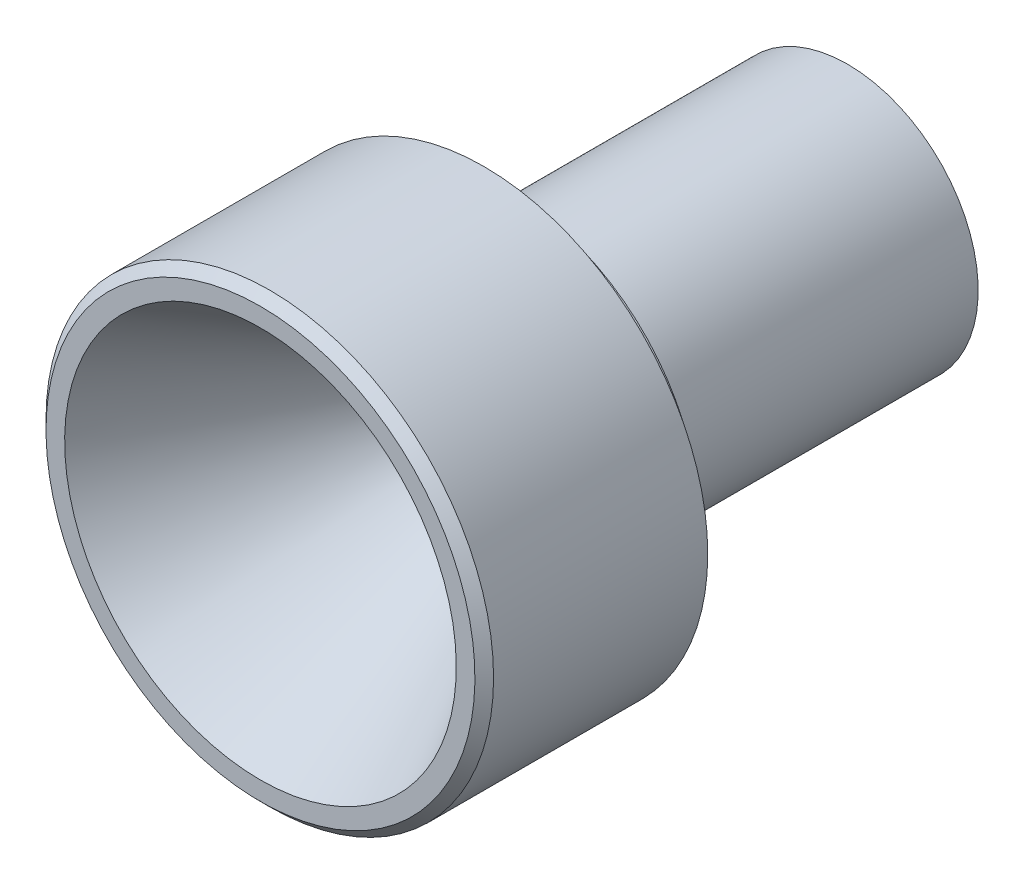
ISO-10303-21;
HEADER;
FILE_DESCRIPTION(('STEP AP214'),'2;1');
FILE_NAME('part.step','',(''),(''),'','','');
FILE_SCHEMA(('AUTOMOTIVE_DESIGN { 1 0 10303 214 1 1 1 1 }'));
ENDSEC;
DATA;
#1=APPLICATION_CONTEXT('core data for automotive mechanical design processes');
#2=APPLICATION_PROTOCOL_DEFINITION('international standard','automotive_design',2000,#1);
#3=PRODUCT_CONTEXT('',#1,'mechanical');
#4=PRODUCT('Part','Part','',(#3));
#5=PRODUCT_RELATED_PRODUCT_CATEGORY('part','',(#4));
#6=PRODUCT_DEFINITION_FORMATION('','',#4);
#7=PRODUCT_DEFINITION_CONTEXT('part definition',#1,'design');
#8=PRODUCT_DEFINITION('design','',#6,#7);
#9=PRODUCT_DEFINITION_SHAPE('','',#8);
#10=(LENGTH_UNIT() NAMED_UNIT(*) SI_UNIT(.MILLI.,.METRE.));
#11=(NAMED_UNIT(*) PLANE_ANGLE_UNIT() SI_UNIT($,.RADIAN.));
#12=(NAMED_UNIT(*) SI_UNIT($,.STERADIAN.) SOLID_ANGLE_UNIT());
#13=UNCERTAINTY_MEASURE_WITH_UNIT(LENGTH_MEASURE(1.E-05),#10,'distance_accuracy_value','');
#14=(GEOMETRIC_REPRESENTATION_CONTEXT(3) GLOBAL_UNCERTAINTY_ASSIGNED_CONTEXT((#13)) GLOBAL_UNIT_ASSIGNED_CONTEXT((#10,
#11,#12)) REPRESENTATION_CONTEXT('',''));
#15=CARTESIAN_POINT('',(0.,0.,0.));
#16=DIRECTION('',(0.,0.,1.));
#17=DIRECTION('',(1.,0.,0.));
#18=AXIS2_PLACEMENT_3D('',#15,#16,#17);
#19=CARTESIAN_POINT('',(0.,0.,15.742003569016));
#20=DIRECTION('',(0.,0.,1.));
#21=DIRECTION('',(0.,-1.,0.));
#22=AXIS2_PLACEMENT_3D('',#19,#20,#21);
#23=CYLINDRICAL_SURFACE('',#22,12.);
#24=CARTESIAN_POINT('',(0.,0.,15.242003569016));
#25=DIRECTION('',(0.,0.,-1.));
#26=DIRECTION('',(0.,1.,0.));
#27=AXIS2_PLACEMENT_3D('',#24,#25,#26);
#28=CIRCLE('',#27,12.);
#29=CARTESIAN_POINT('',(0.,12.,15.242003569016));
#30=VERTEX_POINT('',#29);
#31=EDGE_CURVE('E10',#30,#30,#28,.T.);
#32=ORIENTED_EDGE('',*,*,#31,.T.);
#33=EDGE_LOOP('',(#32));
#34=FACE_BOUND('',#33,.T.);
#35=CARTESIAN_POINT('',(0.,0.,3.75799643098404));
#36=DIRECTION('',(0.,0.,1.));
#37=DIRECTION('',(0.,-1.,0.));
#38=AXIS2_PLACEMENT_3D('',#35,#36,#37);
#39=CIRCLE('',#38,12.);
#40=CARTESIAN_POINT('',(0.,-12.,3.75799643098404));
#41=VERTEX_POINT('',#40);
#42=EDGE_CURVE('E42',#41,#41,#39,.T.);
#43=ORIENTED_EDGE('',*,*,#42,.T.);
#44=EDGE_LOOP('',(#43));
#45=FACE_BOUND('',#44,.T.);
#46=ADVANCED_FACE('F31',(#34,#45),#23,.T.);
#47=CARTESIAN_POINT('',(0.,12.,3.75799643098404));
#48=DIRECTION('',(0.,0.,1.));
#49=DIRECTION('',(0.,-1.,0.));
#50=AXIS2_PLACEMENT_3D('',#47,#48,#49);
#51=PLANE('',#50);
#52=ORIENTED_EDGE('',*,*,#42,.F.);
#53=EDGE_LOOP('',(#52));
#54=FACE_BOUND('',#53,.T.);
#55=CARTESIAN_POINT('',(0.,0.,3.75799643098404));
#56=DIRECTION('',(0.,0.,1.));
#57=DIRECTION('',(0.,-1.,0.));
#58=AXIS2_PLACEMENT_3D('',#55,#56,#57);
#59=CIRCLE('',#58,10.);
#60=CARTESIAN_POINT('',(0.,-10.,3.75799643098404));
#61=VERTEX_POINT('',#60);
#62=EDGE_CURVE('E46',#61,#61,#59,.T.);
#63=ORIENTED_EDGE('',*,*,#62,.T.);
#64=EDGE_LOOP('',(#63));
#65=FACE_BOUND('',#64,.T.);
#66=ADVANCED_FACE('F88',(#54,#65),#51,.F.);
#67=CARTESIAN_POINT('',(0.,0.,15.742003569016));
#68=DIRECTION('',(0.,0.,1.));
#69=DIRECTION('',(0.,-1.,0.));
#70=AXIS2_PLACEMENT_3D('',#67,#68,#69);
#71=CYLINDRICAL_SURFACE('',#70,10.);
#72=ORIENTED_EDGE('',*,*,#62,.F.);
#73=EDGE_LOOP('',(#72));
#74=FACE_BOUND('',#73,.T.);
#75=CARTESIAN_POINT('',(0.,0.,2.25799643098404));
#76=DIRECTION('',(0.,0.,1.));
#77=DIRECTION('',(0.,-1.,0.));
#78=AXIS2_PLACEMENT_3D('',#75,#76,#77);
#79=CIRCLE('',#78,10.);
#80=CARTESIAN_POINT('',(0.,-10.,2.25799643098404));
#81=VERTEX_POINT('',#80);
#82=EDGE_CURVE('E51',#81,#81,#79,.T.);
#83=ORIENTED_EDGE('',*,*,#82,.T.);
#84=EDGE_LOOP('',(#83));
#85=FACE_BOUND('',#84,.T.);
#86=ADVANCED_FACE('F93',(#74,#85),#71,.T.);
#87=CARTESIAN_POINT('',(0.,10.,2.25799643098404));
#88=DIRECTION('',(0.,0.,1.));
#89=DIRECTION('',(0.,-1.,0.));
#90=AXIS2_PLACEMENT_3D('',#87,#88,#89);
#91=PLANE('',#90);
#92=ORIENTED_EDGE('',*,*,#82,.F.);
#93=EDGE_LOOP('',(#92));
#94=FACE_BOUND('',#93,.T.);
#95=CARTESIAN_POINT('',(0.,0.,2.25799643098404));
#96=DIRECTION('',(0.,0.,1.));
#97=DIRECTION('',(0.,-1.,0.));
#98=AXIS2_PLACEMENT_3D('',#95,#96,#97);
#99=CIRCLE('',#98,7.);
#100=CARTESIAN_POINT('',(0.,-7.,2.25799643098404));
#101=VERTEX_POINT('',#100);
#102=EDGE_CURVE('E54',#101,#101,#99,.T.);
#103=ORIENTED_EDGE('',*,*,#102,.T.);
#104=EDGE_LOOP('',(#103));
#105=FACE_BOUND('',#104,.T.);
#106=ADVANCED_FACE('F100',(#94,#105),#91,.F.);
#107=CARTESIAN_POINT('',(0.,0.,15.742003569016));
#108=DIRECTION('',(0.,0.,1.));
#109=DIRECTION('',(0.,-1.,0.));
#110=AXIS2_PLACEMENT_3D('',#107,#108,#109);
#111=CYLINDRICAL_SURFACE('',#110,7.);
#112=ORIENTED_EDGE('',*,*,#102,.F.);
#113=EDGE_LOOP('',(#112));
#114=FACE_BOUND('',#113,.T.);
#115=CARTESIAN_POINT('',(0.,0.,-15.742003569016));
#116=DIRECTION('',(0.,0.,1.));
#117=DIRECTION('',(0.,-1.,0.));
#118=AXIS2_PLACEMENT_3D('',#115,#116,#117);
#119=CIRCLE('',#118,7.);
#120=CARTESIAN_POINT('',(0.,-7.,-15.742003569016));
#121=VERTEX_POINT('',#120);
#122=EDGE_CURVE('E57',#121,#121,#119,.T.);
#123=ORIENTED_EDGE('',*,*,#122,.T.);
#124=EDGE_LOOP('',(#123));
#125=FACE_BOUND('',#124,.T.);
#126=ADVANCED_FACE('F104',(#114,#125),#111,.T.);
#127=CARTESIAN_POINT('',(0.,7.,-15.742003569016));
#128=DIRECTION('',(0.,0.,1.));
#129=DIRECTION('',(0.,-1.,0.));
#130=AXIS2_PLACEMENT_3D('',#127,#128,#129);
#131=PLANE('',#130);
#132=ORIENTED_EDGE('',*,*,#122,.F.);
#133=EDGE_LOOP('',(#132));
#134=FACE_BOUND('',#133,.T.);
#135=CARTESIAN_POINT('',(0.,0.,-15.742003569016));
#136=DIRECTION('',(0.,0.,1.));
#137=DIRECTION('',(0.,-1.,0.));
#138=AXIS2_PLACEMENT_3D('',#135,#136,#137);
#139=CIRCLE('',#138,4.5);
#140=CARTESIAN_POINT('',(0.,-4.5,-15.742003569016));
#141=VERTEX_POINT('',#140);
#142=EDGE_CURVE('E60',#141,#141,#139,.T.);
#143=ORIENTED_EDGE('',*,*,#142,.T.);
#144=EDGE_LOOP('',(#143));
#145=FACE_BOUND('',#144,.T.);
#146=ADVANCED_FACE('F108',(#134,#145),#131,.F.);
#147=CARTESIAN_POINT('',(0.,0.,-3.98042829531944));
#148=DIRECTION('',(0.,0.,-1.));
#149=DIRECTION('',(0.,1.,0.));
#150=AXIS2_PLACEMENT_3D('',#147,#148,#149);
#151=CONICAL_SURFACE('',#150,2.,0.209439510239313);
#152=ORIENTED_EDGE('',*,*,#142,.F.);
#153=EDGE_LOOP('',(#152));
#154=FACE_BOUND('',#153,.T.);
#155=CARTESIAN_POINT('',(0.,0.,-3.98042829531944));
#156=DIRECTION('',(0.,0.,1.));
#157=DIRECTION('',(0.,-1.,0.));
#158=AXIS2_PLACEMENT_3D('',#155,#156,#157);
#159=CIRCLE('',#158,2.);
#160=CARTESIAN_POINT('',(0.,-2.,-3.98042829531944));
#161=VERTEX_POINT('',#160);
#162=EDGE_CURVE('E63',#161,#161,#159,.T.);
#163=ORIENTED_EDGE('',*,*,#162,.T.);
#164=EDGE_LOOP('',(#163));
#165=FACE_BOUND('',#164,.T.);
#166=ADVANCED_FACE('F112',(#154,#165),#151,.F.);
#167=CARTESIAN_POINT('',(0.,0.,15.742003569016));
#168=DIRECTION('',(0.,0.,1.));
#169=DIRECTION('',(0.,-1.,0.));
#170=AXIS2_PLACEMENT_3D('',#167,#168,#169);
#171=CYLINDRICAL_SURFACE('',#170,2.);
#172=ORIENTED_EDGE('',*,*,#162,.F.);
#173=EDGE_LOOP('',(#172));
#174=FACE_BOUND('',#173,.T.);
#175=CARTESIAN_POINT('',(0.,0.,1.01957170468056));
#176=DIRECTION('',(0.,0.,1.));
#177=DIRECTION('',(0.,-1.,0.));
#178=AXIS2_PLACEMENT_3D('',#175,#176,#177);
#179=CIRCLE('',#178,2.);
#180=CARTESIAN_POINT('',(0.,-2.,1.01957170468056));
#181=VERTEX_POINT('',#180);
#182=EDGE_CURVE('E66',#181,#181,#179,.T.);
#183=ORIENTED_EDGE('',*,*,#182,.T.);
#184=EDGE_LOOP('',(#183));
#185=FACE_BOUND('',#184,.T.);
#186=ADVANCED_FACE('F85',(#174,#185),#171,.F.);
#187=CARTESIAN_POINT('',(0.,0.,15.742003569016));
#188=DIRECTION('',(0.,0.,1.));
#189=DIRECTION('',(0.,-1.,0.));
#190=AXIS2_PLACEMENT_3D('',#187,#188,#189);
#191=CONICAL_SURFACE('',#190,10.5,0.523598775598301);
#192=ORIENTED_EDGE('',*,*,#182,.F.);
#193=EDGE_LOOP('',(#192));
#194=FACE_BOUND('',#193,.T.);
#195=CARTESIAN_POINT('',(0.,0.,15.742003569016));
#196=DIRECTION('',(0.,0.,1.));
#197=DIRECTION('',(0.,-1.,0.));
#198=AXIS2_PLACEMENT_3D('',#195,#196,#197);
#199=CIRCLE('',#198,10.5);
#200=CARTESIAN_POINT('',(0.,-10.5,15.742003569016));
#201=VERTEX_POINT('',#200);
#202=EDGE_CURVE('E69',#201,#201,#199,.T.);
#203=ORIENTED_EDGE('',*,*,#202,.T.);
#204=EDGE_LOOP('',(#203));
#205=FACE_BOUND('',#204,.T.);
#206=ADVANCED_FACE('F73',(#194,#205),#191,.F.);
#207=CARTESIAN_POINT('',(0.,12.,15.742003569016));
#208=DIRECTION('',(0.,0.,-1.));
#209=DIRECTION('',(0.,1.,0.));
#210=AXIS2_PLACEMENT_3D('',#207,#208,#209);
#211=PLANE('',#210);
#212=CARTESIAN_POINT('',(0.,0.,15.742003569016));
#213=DIRECTION('',(0.,0.,-1.));
#214=DIRECTION('',(0.,1.,0.));
#215=AXIS2_PLACEMENT_3D('',#212,#213,#214);
#216=CIRCLE('',#215,11.5);
#217=CARTESIAN_POINT('',(0.,11.5,15.742003569016));
#218=VERTEX_POINT('',#217);
#219=EDGE_CURVE('E38',#218,#218,#216,.F.);
#220=ORIENTED_EDGE('',*,*,#219,.T.);
#221=EDGE_LOOP('',(#220));
#222=FACE_BOUND('',#221,.T.);
#223=ORIENTED_EDGE('',*,*,#202,.F.);
#224=EDGE_LOOP('',(#223));
#225=FACE_BOUND('',#224,.T.);
#226=ADVANCED_FACE('F75',(#222,#225),#211,.F.);
#227=CARTESIAN_POINT('',(0.,0.,15.742003569016));
#228=DIRECTION('',(0.,0.,-1.));
#229=DIRECTION('',(0.,1.,0.));
#230=AXIS2_PLACEMENT_3D('',#227,#228,#229);
#231=CONICAL_SURFACE('',#230,11.5,0.785398163397448);
#232=ORIENTED_EDGE('',*,*,#31,.F.);
#233=EDGE_LOOP('',(#232));
#234=FACE_BOUND('',#233,.T.);
#235=ORIENTED_EDGE('',*,*,#219,.F.);
#236=EDGE_LOOP('',(#235));
#237=FACE_BOUND('',#236,.T.);
#238=ADVANCED_FACE('F33',(#234,#237),#231,.T.);
#239=CLOSED_SHELL('',(#46,#66,#86,#106,#126,#146,#166,#186,#206,#226,#238));
#240=MANIFOLD_SOLID_BREP('B2',#239);
#241=ADVANCED_BREP_SHAPE_REPRESENTATION('',(#18,#240),#14);
#242=SHAPE_DEFINITION_REPRESENTATION(#9,#241);
ENDSEC;
END-ISO-10303-21;
